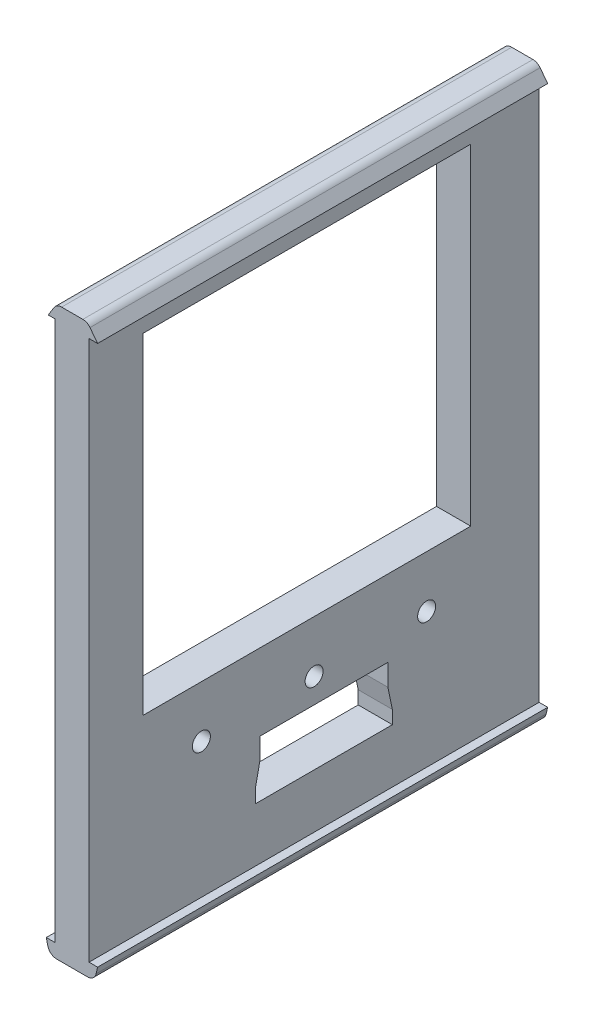
ISO-10303-21;
HEADER;
FILE_DESCRIPTION(('STEP AP214'),'2;1');
FILE_NAME('part.step','',(''),(''),'','','');
FILE_SCHEMA(('AUTOMOTIVE_DESIGN { 1 0 10303 214 1 1 1 1 }'));
ENDSEC;
DATA;
#1=APPLICATION_CONTEXT('core data for automotive mechanical design processes');
#2=APPLICATION_PROTOCOL_DEFINITION('international standard','automotive_design',2000,#1);
#3=PRODUCT_CONTEXT('',#1,'mechanical');
#4=PRODUCT('Part','Part','',(#3));
#5=PRODUCT_RELATED_PRODUCT_CATEGORY('part','',(#4));
#6=PRODUCT_DEFINITION_FORMATION('','',#4);
#7=PRODUCT_DEFINITION_CONTEXT('part definition',#1,'design');
#8=PRODUCT_DEFINITION('design','',#6,#7);
#9=PRODUCT_DEFINITION_SHAPE('','',#8);
#10=(LENGTH_UNIT() NAMED_UNIT(*) SI_UNIT(.MILLI.,.METRE.));
#11=(NAMED_UNIT(*) PLANE_ANGLE_UNIT() SI_UNIT($,.RADIAN.));
#12=(NAMED_UNIT(*) SI_UNIT($,.STERADIAN.) SOLID_ANGLE_UNIT());
#13=UNCERTAINTY_MEASURE_WITH_UNIT(LENGTH_MEASURE(1.E-05),#10,'distance_accuracy_value','');
#14=(GEOMETRIC_REPRESENTATION_CONTEXT(3) GLOBAL_UNCERTAINTY_ASSIGNED_CONTEXT((#13)) GLOBAL_UNIT_ASSIGNED_CONTEXT((#10,
#11,#12)) REPRESENTATION_CONTEXT('',''));
#15=CARTESIAN_POINT('',(0.,0.,0.));
#16=DIRECTION('',(0.,0.,1.));
#17=DIRECTION('',(1.,0.,0.));
#18=AXIS2_PLACEMENT_3D('',#15,#16,#17);
#19=CARTESIAN_POINT('',(-3.8,0.,160.));
#20=DIRECTION('',(-1.,0.,0.));
#21=DIRECTION('',(0.,-1.,0.));
#22=AXIS2_PLACEMENT_3D('',#19,#20,#21);
#23=PLANE('',#22);
#24=DIRECTION('',(0.,0.,1.));
#25=VECTOR('',#24,1.);
#26=CARTESIAN_POINT('',(-3.8,16.8213753410179,160.));
#27=LINE('',#26,#25);
#28=CARTESIAN_POINT('',(-3.8,16.8213753410179,45.2));
#29=VERTEX_POINT('',#28);
#30=CARTESIAN_POINT('',(-3.8,16.8213753410179,118.));
#31=VERTEX_POINT('',#30);
#32=EDGE_CURVE('E272',#29,#31,#27,.T.);
#33=ORIENTED_EDGE('',*,*,#32,.T.);
#34=DIRECTION('',(0.,-1.,0.));
#35=VECTOR('',#34,1.);
#36=CARTESIAN_POINT('',(-3.8,0.,118.));
#37=LINE('',#36,#35);
#38=CARTESIAN_POINT('',(-3.79999999999998,-56.678624658982,118.));
#39=VERTEX_POINT('',#38);
#40=EDGE_CURVE('E281',#31,#39,#37,.T.);
#41=ORIENTED_EDGE('',*,*,#40,.T.);
#42=DIRECTION('',(0.,0.,-1.));
#43=VECTOR('',#42,1.);
#44=CARTESIAN_POINT('',(-3.79999999999999,-56.678624658982,160.));
#45=LINE('',#44,#43);
#46=CARTESIAN_POINT('',(-3.79999999999999,-56.678624658982,45.2));
#47=VERTEX_POINT('',#46);
#48=EDGE_CURVE('E278',#39,#47,#45,.T.);
#49=ORIENTED_EDGE('',*,*,#48,.T.);
#50=DIRECTION('',(0.,1.,0.));
#51=VECTOR('',#50,1.);
#52=CARTESIAN_POINT('',(-3.8,0.,45.2));
#53=LINE('',#52,#51);
#54=EDGE_CURVE('E275',#47,#29,#53,.T.);
#55=ORIENTED_EDGE('',*,*,#54,.T.);
#56=EDGE_LOOP('',(#33,#41,#49,#55));
#57=FACE_BOUND('',#56,.T.);
#58=CARTESIAN_POINT('',(-3.79999999999999,-68.178624658982,55.));
#59=DIRECTION('',(-1.,0.,0.));
#60=DIRECTION('',(0.,-1.,0.));
#61=AXIS2_PLACEMENT_3D('',#58,#59,#60);
#62=CIRCLE('',#61,2.);
#63=CARTESIAN_POINT('',(-3.79999999999999,-70.178624658982,55.));
#64=VERTEX_POINT('',#63);
#65=EDGE_CURVE('E346',#64,#64,#62,.F.);
#66=ORIENTED_EDGE('',*,*,#65,.T.);
#67=EDGE_LOOP('',(#66));
#68=FACE_BOUND('',#67,.T.);
#69=DIRECTION('',(0.,-1.,0.));
#70=VECTOR('',#69,1.);
#71=CARTESIAN_POINT('',(-3.8,21.821375341018,130.));
#72=LINE('',#71,#70);
#73=CARTESIAN_POINT('',(-3.8,21.821375341018,130.));
#74=VERTEX_POINT('',#73);
#75=CARTESIAN_POINT('',(-3.8,-98.178624658982,130.));
#76=VERTEX_POINT('',#75);
#77=EDGE_CURVE('E356',#74,#76,#72,.T.);
#78=ORIENTED_EDGE('',*,*,#77,.F.);
#79=DIRECTION('',(0.,0.,-1.));
#80=VECTOR('',#79,1.);
#81=CARTESIAN_POINT('',(-3.8,21.821375341018,160.));
#82=LINE('',#81,#80);
#83=CARTESIAN_POINT('',(-3.8,21.821375341018,30.));
#84=VERTEX_POINT('',#83);
#85=EDGE_CURVE('E401',#74,#84,#82,.T.);
#86=ORIENTED_EDGE('',*,*,#85,.T.);
#87=DIRECTION('',(0.,-1.,0.));
#88=VECTOR('',#87,1.);
#89=CARTESIAN_POINT('',(-3.8,21.821375341018,30.));
#90=LINE('',#89,#88);
#91=CARTESIAN_POINT('',(-3.79999999999998,-98.178624658982,30.));
#92=VERTEX_POINT('',#91);
#93=EDGE_CURVE('E359',#84,#92,#90,.T.);
#94=ORIENTED_EDGE('',*,*,#93,.T.);
#95=DIRECTION('',(0.,0.,-1.));
#96=VECTOR('',#95,1.);
#97=CARTESIAN_POINT('',(-3.79999999999998,-98.178624658982,160.));
#98=LINE('',#97,#96);
#99=EDGE_CURVE('E405',#76,#92,#98,.T.);
#100=ORIENTED_EDGE('',*,*,#99,.F.);
#101=EDGE_LOOP('',(#78,#86,#94,#100));
#102=FACE_BOUND('',#101,.T.);
#103=CARTESIAN_POINT('',(-3.79999999999999,-68.178624658982,80.));
#104=DIRECTION('',(-1.,0.,0.));
#105=DIRECTION('',(0.,-1.,0.));
#106=AXIS2_PLACEMENT_3D('',#103,#104,#105);
#107=CIRCLE('',#106,2.);
#108=CARTESIAN_POINT('',(-3.79999999999999,-70.178624658982,80.));
#109=VERTEX_POINT('',#108);
#110=EDGE_CURVE('E352',#109,#109,#107,.F.);
#111=ORIENTED_EDGE('',*,*,#110,.T.);
#112=EDGE_LOOP('',(#111));
#113=FACE_BOUND('',#112,.T.);
#114=CARTESIAN_POINT('',(-3.79999999999999,-68.178624658982,105.042568922673));
#115=DIRECTION('',(-1.,0.,0.));
#116=DIRECTION('',(0.,-1.,0.));
#117=AXIS2_PLACEMENT_3D('',#114,#115,#116);
#118=CIRCLE('',#117,2.);
#119=CARTESIAN_POINT('',(-3.79999999999999,-70.178624658982,105.042568922673));
#120=VERTEX_POINT('',#119);
#121=EDGE_CURVE('E340',#120,#120,#118,.F.);
#122=ORIENTED_EDGE('',*,*,#121,.T.);
#123=EDGE_LOOP('',(#122));
#124=FACE_BOUND('',#123,.T.);
#125=DIRECTION('',(0.,0.97887309504818,0.204468735484905));
#126=VECTOR('',#125,1.);
#127=CARTESIAN_POINT('',(-3.8,16.0123896452633,83.3423272560244));
#128=LINE('',#127,#126);
#129=CARTESIAN_POINT('',(-3.79999999999998,-83.2534194825206,62.6075102793204));
#130=VERTEX_POINT('',#129);
#131=CARTESIAN_POINT('',(-3.79999999999998,-78.4660220707513,63.6075102793204));
#132=VERTEX_POINT('',#131);
#133=EDGE_CURVE('E224',#130,#132,#128,.T.);
#134=ORIENTED_EDGE('',*,*,#133,.T.);
#135=DIRECTION('',(0.,1.,0.));
#136=VECTOR('',#135,1.);
#137=CARTESIAN_POINT('',(-3.8,0.,63.6075102793204));
#138=LINE('',#137,#136);
#139=CARTESIAN_POINT('',(-3.79999999999998,-73.6786246589821,63.6075102793204));
#140=VERTEX_POINT('',#139);
#141=EDGE_CURVE('E259',#132,#140,#138,.T.);
#142=ORIENTED_EDGE('',*,*,#141,.T.);
#143=DIRECTION('',(0.,0.,1.));
#144=VECTOR('',#143,1.);
#145=CARTESIAN_POINT('',(-3.79999999999998,-73.6786246589821,160.));
#146=LINE('',#145,#144);
#147=CARTESIAN_POINT('',(-3.79999999999998,-73.6786246589821,92.0575102793204));
#148=VERTEX_POINT('',#147);
#149=EDGE_CURVE('E256',#140,#148,#146,.T.);
#150=ORIENTED_EDGE('',*,*,#149,.T.);
#151=DIRECTION('',(0.,-1.,0.));
#152=VECTOR('',#151,1.);
#153=CARTESIAN_POINT('',(-3.8,0.,92.0575102793204));
#154=LINE('',#153,#152);
#155=CARTESIAN_POINT('',(-3.79999999999998,-78.4660220707513,92.0575102793204));
#156=VERTEX_POINT('',#155);
#157=EDGE_CURVE('E253',#148,#156,#154,.T.);
#158=ORIENTED_EDGE('',*,*,#157,.T.);
#159=DIRECTION('',(0.,-0.97887309504818,0.204468735484907));
#160=VECTOR('',#159,1.);
#161=CARTESIAN_POINT('',(-3.79999999999999,-16.8790829430984,79.193122005172));
#162=LINE('',#161,#160);
#163=CARTESIAN_POINT('',(-3.79999999999998,-83.2534194825206,93.0575102793204));
#164=VERTEX_POINT('',#163);
#165=EDGE_CURVE('E250',#156,#164,#162,.T.);
#166=ORIENTED_EDGE('',*,*,#165,.T.);
#167=DIRECTION('',(0.,-1.,0.));
#168=VECTOR('',#167,1.);
#169=CARTESIAN_POINT('',(-3.8,0.,93.0575102793204));
#170=LINE('',#169,#168);
#171=CARTESIAN_POINT('',(-3.79999999999998,-86.1786246589821,93.0575102793204));
#172=VERTEX_POINT('',#171);
#173=EDGE_CURVE('E245',#164,#172,#170,.T.);
#174=ORIENTED_EDGE('',*,*,#173,.T.);
#175=DIRECTION('',(0.,0.,-1.));
#176=VECTOR('',#175,1.);
#177=CARTESIAN_POINT('',(-3.79999999999998,-86.1786246589821,160.));
#178=LINE('',#177,#176);
#179=CARTESIAN_POINT('',(-3.79999999999998,-86.1786246589821,62.6075102793204));
#180=VERTEX_POINT('',#179);
#181=EDGE_CURVE('E243',#172,#180,#178,.T.);
#182=ORIENTED_EDGE('',*,*,#181,.T.);
#183=DIRECTION('',(0.,1.,0.));
#184=VECTOR('',#183,1.);
#185=CARTESIAN_POINT('',(-3.8,0.,62.6075102793204));
#186=LINE('',#185,#184);
#187=EDGE_CURVE('E229',#180,#130,#186,.T.);
#188=ORIENTED_EDGE('',*,*,#187,.T.);
#189=EDGE_LOOP('',(#134,#142,#150,#158,#166,#174,#182,#188));
#190=FACE_BOUND('',#189,.T.);
#191=ADVANCED_FACE('F44',(#57,#68,#102,#113,#124,#190),#23,.T.);
#192=CARTESIAN_POINT('',(3.8,0.,160.));
#193=DIRECTION('',(-1.,0.,0.));
#194=DIRECTION('',(0.,-1.,0.));
#195=AXIS2_PLACEMENT_3D('',#192,#193,#194);
#196=PLANE('',#195);
#197=DIRECTION('',(0.,-1.,0.));
#198=VECTOR('',#197,1.);
#199=CARTESIAN_POINT('',(3.8,0.,118.));
#200=LINE('',#199,#198);
#201=CARTESIAN_POINT('',(3.8,16.821375341018,118.));
#202=VERTEX_POINT('',#201);
#203=CARTESIAN_POINT('',(3.80000000000001,-56.678624658982,118.));
#204=VERTEX_POINT('',#203);
#205=EDGE_CURVE('E556',#202,#204,#200,.T.);
#206=ORIENTED_EDGE('',*,*,#205,.F.);
#207=DIRECTION('',(0.,0.,1.));
#208=VECTOR('',#207,1.);
#209=CARTESIAN_POINT('',(3.8,16.821375341018,160.));
#210=LINE('',#209,#208);
#211=CARTESIAN_POINT('',(3.8,16.821375341018,45.2));
#212=VERTEX_POINT('',#211);
#213=EDGE_CURVE('E481',#212,#202,#210,.T.);
#214=ORIENTED_EDGE('',*,*,#213,.F.);
#215=DIRECTION('',(0.,1.,0.));
#216=VECTOR('',#215,1.);
#217=CARTESIAN_POINT('',(3.8,0.,45.2));
#218=LINE('',#217,#216);
#219=CARTESIAN_POINT('',(3.80000000000001,-56.678624658982,45.2));
#220=VERTEX_POINT('',#219);
#221=EDGE_CURVE('E753',#220,#212,#218,.T.);
#222=ORIENTED_EDGE('',*,*,#221,.F.);
#223=DIRECTION('',(0.,0.,-1.));
#224=VECTOR('',#223,1.);
#225=CARTESIAN_POINT('',(3.80000000000001,-56.678624658982,160.));
#226=LINE('',#225,#224);
#227=EDGE_CURVE('E755',#204,#220,#226,.T.);
#228=ORIENTED_EDGE('',*,*,#227,.F.);
#229=EDGE_LOOP('',(#206,#214,#222,#228));
#230=FACE_BOUND('',#229,.T.);
#231=CARTESIAN_POINT('',(3.80000000000002,-68.178624658982,55.));
#232=DIRECTION('',(1.,0.,0.));
#233=DIRECTION('',(0.,0.,-1.));
#234=AXIS2_PLACEMENT_3D('',#231,#232,#233);
#235=CIRCLE('',#234,2.);
#236=CARTESIAN_POINT('',(3.80000000000002,-68.178624658982,53.));
#237=VERTEX_POINT('',#236);
#238=EDGE_CURVE('E343',#237,#237,#235,.T.);
#239=ORIENTED_EDGE('',*,*,#238,.F.);
#240=EDGE_LOOP('',(#239));
#241=FACE_BOUND('',#240,.T.);
#242=DIRECTION('',(0.,0.,-1.));
#243=VECTOR('',#242,1.);
#244=CARTESIAN_POINT('',(3.8,21.821375341018,160.));
#245=LINE('',#244,#243);
#246=CARTESIAN_POINT('',(3.8,21.821375341018,130.));
#247=VERTEX_POINT('',#246);
#248=CARTESIAN_POINT('',(3.8,21.821375341018,30.));
#249=VERTEX_POINT('',#248);
#250=EDGE_CURVE('E389',#247,#249,#245,.T.);
#251=ORIENTED_EDGE('',*,*,#250,.F.);
#252=DIRECTION('',(0.,1.,0.));
#253=VECTOR('',#252,1.);
#254=CARTESIAN_POINT('',(3.80000000000002,21.821375341018,130.));
#255=LINE('',#254,#253);
#256=CARTESIAN_POINT('',(3.80000000000002,-98.178624658982,130.));
#257=VERTEX_POINT('',#256);
#258=EDGE_CURVE('E355',#257,#247,#255,.T.);
#259=ORIENTED_EDGE('',*,*,#258,.F.);
#260=DIRECTION('',(0.,0.,-1.));
#261=VECTOR('',#260,1.);
#262=CARTESIAN_POINT('',(3.80000000000002,-98.178624658982,160.));
#263=LINE('',#262,#261);
#264=CARTESIAN_POINT('',(3.80000000000002,-98.178624658982,30.));
#265=VERTEX_POINT('',#264);
#266=EDGE_CURVE('E398',#257,#265,#263,.T.);
#267=ORIENTED_EDGE('',*,*,#266,.T.);
#268=DIRECTION('',(0.,1.,0.));
#269=VECTOR('',#268,1.);
#270=CARTESIAN_POINT('',(3.80000000000002,21.821375341018,30.));
#271=LINE('',#270,#269);
#272=EDGE_CURVE('E368',#265,#249,#271,.T.);
#273=ORIENTED_EDGE('',*,*,#272,.T.);
#274=EDGE_LOOP('',(#251,#259,#267,#273));
#275=FACE_BOUND('',#274,.T.);
#276=CARTESIAN_POINT('',(3.80000000000002,-68.178624658982,80.));
#277=DIRECTION('',(1.,0.,0.));
#278=DIRECTION('',(0.,0.,-1.));
#279=AXIS2_PLACEMENT_3D('',#276,#277,#278);
#280=CIRCLE('',#279,2.);
#281=CARTESIAN_POINT('',(3.80000000000002,-68.178624658982,78.));
#282=VERTEX_POINT('',#281);
#283=EDGE_CURVE('E349',#282,#282,#280,.T.);
#284=ORIENTED_EDGE('',*,*,#283,.F.);
#285=EDGE_LOOP('',(#284));
#286=FACE_BOUND('',#285,.T.);
#287=CARTESIAN_POINT('',(3.80000000000002,-68.178624658982,105.042568922673));
#288=DIRECTION('',(1.,0.,0.));
#289=DIRECTION('',(0.,0.,-1.));
#290=AXIS2_PLACEMENT_3D('',#287,#288,#289);
#291=CIRCLE('',#290,2.);
#292=CARTESIAN_POINT('',(3.80000000000002,-68.178624658982,103.042568922673));
#293=VERTEX_POINT('',#292);
#294=EDGE_CURVE('E337',#293,#293,#291,.T.);
#295=ORIENTED_EDGE('',*,*,#294,.F.);
#296=EDGE_LOOP('',(#295));
#297=FACE_BOUND('',#296,.T.);
#298=DIRECTION('',(0.,1.,0.));
#299=VECTOR('',#298,1.);
#300=CARTESIAN_POINT('',(3.8,0.,63.6075102793204));
#301=LINE('',#300,#299);
#302=CARTESIAN_POINT('',(3.80000000000002,-78.4660220707513,63.6075102793204));
#303=VERTEX_POINT('',#302);
#304=CARTESIAN_POINT('',(3.80000000000002,-73.6786246589821,63.6075102793204));
#305=VERTEX_POINT('',#304);
#306=EDGE_CURVE('E12',#303,#305,#301,.T.);
#307=ORIENTED_EDGE('',*,*,#306,.F.);
#308=DIRECTION('',(0.,0.97887309504818,0.204468735484905));
#309=VECTOR('',#308,1.);
#310=CARTESIAN_POINT('',(3.8,16.0123896452633,83.3423272560244));
#311=LINE('',#310,#309);
#312=CARTESIAN_POINT('',(3.80000000000002,-83.2534194825206,62.6075102793204));
#313=VERTEX_POINT('',#312);
#314=EDGE_CURVE('E524',#313,#303,#311,.T.);
#315=ORIENTED_EDGE('',*,*,#314,.F.);
#316=DIRECTION('',(0.,1.,0.));
#317=VECTOR('',#316,1.);
#318=CARTESIAN_POINT('',(3.8,0.,62.6075102793204));
#319=LINE('',#318,#317);
#320=CARTESIAN_POINT('',(3.80000000000002,-86.1786246589821,62.6075102793204));
#321=VERTEX_POINT('',#320);
#322=EDGE_CURVE('E237',#321,#313,#319,.T.);
#323=ORIENTED_EDGE('',*,*,#322,.F.);
#324=DIRECTION('',(0.,0.,-1.));
#325=VECTOR('',#324,1.);
#326=CARTESIAN_POINT('',(3.80000000000002,-86.1786246589821,160.));
#327=LINE('',#326,#325);
#328=CARTESIAN_POINT('',(3.80000000000002,-86.1786246589821,93.0575102793204));
#329=VERTEX_POINT('',#328);
#330=EDGE_CURVE('E551',#329,#321,#327,.T.);
#331=ORIENTED_EDGE('',*,*,#330,.F.);
#332=DIRECTION('',(0.,-1.,0.));
#333=VECTOR('',#332,1.);
#334=CARTESIAN_POINT('',(3.8,0.,93.0575102793204));
#335=LINE('',#334,#333);
#336=CARTESIAN_POINT('',(3.80000000000002,-83.2534194825206,93.0575102793204));
#337=VERTEX_POINT('',#336);
#338=EDGE_CURVE('E554',#337,#329,#335,.T.);
#339=ORIENTED_EDGE('',*,*,#338,.F.);
#340=DIRECTION('',(0.,-0.97887309504818,0.204468735484907));
#341=VECTOR('',#340,1.);
#342=CARTESIAN_POINT('',(3.80000000000001,-16.8790829430984,79.193122005172));
#343=LINE('',#342,#341);
#344=CARTESIAN_POINT('',(3.80000000000002,-78.4660220707513,92.0575102793204));
#345=VERTEX_POINT('',#344);
#346=EDGE_CURVE('E561',#345,#337,#343,.T.);
#347=ORIENTED_EDGE('',*,*,#346,.F.);
#348=DIRECTION('',(0.,-1.,0.));
#349=VECTOR('',#348,1.);
#350=CARTESIAN_POINT('',(3.8,0.,92.0575102793204));
#351=LINE('',#350,#349);
#352=CARTESIAN_POINT('',(3.80000000000002,-73.6786246589821,92.0575102793204));
#353=VERTEX_POINT('',#352);
#354=EDGE_CURVE('E563',#353,#345,#351,.T.);
#355=ORIENTED_EDGE('',*,*,#354,.F.);
#356=DIRECTION('',(0.,0.,1.));
#357=VECTOR('',#356,1.);
#358=CARTESIAN_POINT('',(3.80000000000002,-73.6786246589821,160.));
#359=LINE('',#358,#357);
#360=EDGE_CURVE('E51',#305,#353,#359,.T.);
#361=ORIENTED_EDGE('',*,*,#360,.F.);
#362=EDGE_LOOP('',(#307,#315,#323,#331,#339,#347,#355,#361));
#363=FACE_BOUND('',#362,.T.);
#364=ADVANCED_FACE('F506',(#230,#241,#275,#286,#297,#363),#196,.F.);
#365=CARTESIAN_POINT('',(-7.17106379094956E-13,-98.178624658982,160.));
#366=DIRECTION('',(0.,1.,0.));
#367=DIRECTION('',(-1.,0.,0.));
#368=AXIS2_PLACEMENT_3D('',#365,#366,#367);
#369=PLANE('',#368);
#370=DIRECTION('',(1.,0.,0.));
#371=VECTOR('',#370,1.);
#372=CARTESIAN_POINT('',(-7.17106379094956E-13,-98.178624658982,30.));
#373=LINE('',#372,#371);
#374=CARTESIAN_POINT('',(-5.69999999999999,-98.178624658982,30.));
#375=VERTEX_POINT('',#374);
#376=EDGE_CURVE('E299',#375,#92,#373,.T.);
#377=ORIENTED_EDGE('',*,*,#376,.F.);
#378=DIRECTION('',(0.,0.,-1.));
#379=VECTOR('',#378,1.);
#380=CARTESIAN_POINT('',(-5.69999999999999,-98.178624658982,160.));
#381=LINE('',#380,#379);
#382=CARTESIAN_POINT('',(-5.69999999999999,-98.178624658982,130.));
#383=VERTEX_POINT('',#382);
#384=EDGE_CURVE('E411',#383,#375,#381,.T.);
#385=ORIENTED_EDGE('',*,*,#384,.F.);
#386=DIRECTION('',(-1.,0.,0.));
#387=VECTOR('',#386,1.);
#388=CARTESIAN_POINT('',(-7.17106379094956E-13,-98.178624658982,130.));
#389=LINE('',#388,#387);
#390=EDGE_CURVE('E321',#76,#383,#389,.T.);
#391=ORIENTED_EDGE('',*,*,#390,.F.);
#392=ORIENTED_EDGE('',*,*,#99,.T.);
#393=EDGE_LOOP('',(#377,#385,#391,#392));
#394=FACE_BOUND('',#393,.T.);
#395=ADVANCED_FACE('F467',(#394),#369,.T.);
#396=CARTESIAN_POINT('',(0.,21.821375341018,160.));
#397=DIRECTION('',(0.,-1.,0.));
#398=DIRECTION('',(0.,0.,-1.));
#399=AXIS2_PLACEMENT_3D('',#396,#397,#398);
#400=PLANE('',#399);
#401=DIRECTION('',(-1.,0.,0.));
#402=VECTOR('',#401,1.);
#403=CARTESIAN_POINT('',(0.,21.821375341018,30.));
#404=LINE('',#403,#402);
#405=CARTESIAN_POINT('',(5.70000000000001,21.821375341018,30.));
#406=VERTEX_POINT('',#405);
#407=EDGE_CURVE('E291',#406,#249,#404,.T.);
#408=ORIENTED_EDGE('',*,*,#407,.F.);
#409=DIRECTION('',(0.,0.,-1.));
#410=VECTOR('',#409,1.);
#411=CARTESIAN_POINT('',(5.70000000000001,21.821375341018,160.));
#412=LINE('',#411,#410);
#413=CARTESIAN_POINT('',(5.70000000000001,21.821375341018,130.));
#414=VERTEX_POINT('',#413);
#415=EDGE_CURVE('E386',#414,#406,#412,.T.);
#416=ORIENTED_EDGE('',*,*,#415,.F.);
#417=DIRECTION('',(1.,0.,0.));
#418=VECTOR('',#417,1.);
#419=CARTESIAN_POINT('',(0.,21.821375341018,130.));
#420=LINE('',#419,#418);
#421=EDGE_CURVE('E327',#247,#414,#420,.T.);
#422=ORIENTED_EDGE('',*,*,#421,.F.);
#423=ORIENTED_EDGE('',*,*,#250,.T.);
#424=EDGE_LOOP('',(#408,#416,#422,#423));
#425=FACE_BOUND('',#424,.T.);
#426=ADVANCED_FACE('F503',(#425),#400,.T.);
#427=CARTESIAN_POINT('',(-27.1312025062026,-6.33061391811397,160.));
#428=DIRECTION('',(-0.973841209741793,-0.227229615606419,0.));
#429=DIRECTION('',(0.227229615606419,-0.973841209741793,0.));
#430=AXIS2_PLACEMENT_3D('',#427,#428,#429);
#431=PLANE('',#430);
#432=DIRECTION('',(-0.227229615606419,0.973841209741793,0.));
#433=VECTOR('',#432,1.);
#434=CARTESIAN_POINT('',(-27.1312025062026,-6.33061391811397,30.));
#435=LINE('',#434,#433);
#436=CARTESIAN_POINT('',(-5.36062617938365,-99.6330838901949,30.));
#437=VERTEX_POINT('',#436);
#438=EDGE_CURVE('E311',#437,#375,#435,.T.);
#439=ORIENTED_EDGE('',*,*,#438,.F.);
#440=DIRECTION('',(0.,0.,-1.));
#441=VECTOR('',#440,1.);
#442=CARTESIAN_POINT('',(-5.36062617938366,-99.6330838901949,160.));
#443=LINE('',#442,#441);
#444=CARTESIAN_POINT('',(-5.36062617938366,-99.6330838901949,130.));
#445=VERTEX_POINT('',#444);
#446=EDGE_CURVE('E417',#445,#437,#443,.T.);
#447=ORIENTED_EDGE('',*,*,#446,.F.);
#448=DIRECTION('',(0.227229615606419,-0.973841209741793,0.));
#449=VECTOR('',#448,1.);
#450=CARTESIAN_POINT('',(-27.1312025062026,-6.33061391811397,130.));
#451=LINE('',#450,#449);
#452=EDGE_CURVE('E463',#383,#445,#451,.T.);
#453=ORIENTED_EDGE('',*,*,#452,.F.);
#454=ORIENTED_EDGE('',*,*,#384,.T.);
#455=EDGE_LOOP('',(#439,#447,#453,#454));
#456=FACE_BOUND('',#455,.T.);
#457=ADVANCED_FACE('F462',(#456),#431,.T.);
#458=CARTESIAN_POINT('',(-3.41294375990007,-99.178624658982,160.));
#459=DIRECTION('',(0.,0.,-1.));
#460=DIRECTION('',(-1.,0.,0.));
#461=AXIS2_PLACEMENT_3D('',#458,#459,#460);
#462=CYLINDRICAL_SURFACE('',#461,2.);
#463=ORIENTED_EDGE('',*,*,#446,.T.);
#464=CARTESIAN_POINT('',(-3.41294375990007,-99.178624658982,30.));
#465=DIRECTION('',(0.,0.,1.));
#466=DIRECTION('',(1.,0.,0.));
#467=AXIS2_PLACEMENT_3D('',#464,#465,#466);
#468=CIRCLE('',#467,2.);
#469=CARTESIAN_POINT('',(-3.41294375990007,-101.178624658982,30.));
#470=VERTEX_POINT('',#469);
#471=EDGE_CURVE('E308',#437,#470,#468,.T.);
#472=ORIENTED_EDGE('',*,*,#471,.T.);
#473=DIRECTION('',(0.,0.,-1.));
#474=VECTOR('',#473,1.);
#475=CARTESIAN_POINT('',(-3.41294375990007,-101.178624658982,160.));
#476=LINE('',#475,#474);
#477=CARTESIAN_POINT('',(-3.41294375990007,-101.178624658982,130.));
#478=VERTEX_POINT('',#477);
#479=EDGE_CURVE('E420',#478,#470,#476,.T.);
#480=ORIENTED_EDGE('',*,*,#479,.F.);
#481=CARTESIAN_POINT('',(-3.41294375990007,-99.178624658982,130.));
#482=DIRECTION('',(0.,0.,-1.));
#483=DIRECTION('',(-1.,0.,0.));
#484=AXIS2_PLACEMENT_3D('',#481,#482,#483);
#485=CIRCLE('',#484,2.);
#486=EDGE_CURVE('E459',#478,#445,#485,.T.);
#487=ORIENTED_EDGE('',*,*,#486,.T.);
#488=EDGE_LOOP('',(#463,#472,#480,#487));
#489=FACE_BOUND('',#488,.T.);
#490=ADVANCED_FACE('F456',(#489),#462,.T.);
#491=CARTESIAN_POINT('',(0.,-101.178624658982,160.));
#492=DIRECTION('',(0.,1.,0.));
#493=DIRECTION('',(0.,0.,1.));
#494=AXIS2_PLACEMENT_3D('',#491,#492,#493);
#495=PLANE('',#494);
#496=ORIENTED_EDGE('',*,*,#479,.T.);
#497=DIRECTION('',(1.,0.,0.));
#498=VECTOR('',#497,1.);
#499=CARTESIAN_POINT('',(0.,-101.178624658982,30.));
#500=LINE('',#499,#498);
#501=CARTESIAN_POINT('',(3.4129437599001,-101.178624658982,30.));
#502=VERTEX_POINT('',#501);
#503=EDGE_CURVE('E305',#470,#502,#500,.T.);
#504=ORIENTED_EDGE('',*,*,#503,.T.);
#505=DIRECTION('',(0.,0.,-1.));
#506=VECTOR('',#505,1.);
#507=CARTESIAN_POINT('',(3.4129437599001,-101.178624658982,160.));
#508=LINE('',#507,#506);
#509=CARTESIAN_POINT('',(3.4129437599001,-101.178624658982,130.));
#510=VERTEX_POINT('',#509);
#511=EDGE_CURVE('E423',#510,#502,#508,.T.);
#512=ORIENTED_EDGE('',*,*,#511,.F.);
#513=DIRECTION('',(-1.,0.,0.));
#514=VECTOR('',#513,1.);
#515=CARTESIAN_POINT('',(0.,-101.178624658982,130.));
#516=LINE('',#515,#514);
#517=EDGE_CURVE('E452',#510,#478,#516,.T.);
#518=ORIENTED_EDGE('',*,*,#517,.T.);
#519=EDGE_LOOP('',(#496,#504,#512,#518));
#520=FACE_BOUND('',#519,.T.);
#521=ADVANCED_FACE('F451',(#520),#495,.F.);
#522=CARTESIAN_POINT('',(3.4129437599001,-99.178624658982,160.));
#523=DIRECTION('',(0.,0.,-1.));
#524=DIRECTION('',(-1.,0.,0.));
#525=AXIS2_PLACEMENT_3D('',#522,#523,#524);
#526=CYLINDRICAL_SURFACE('',#525,2.);
#527=ORIENTED_EDGE('',*,*,#511,.T.);
#528=CARTESIAN_POINT('',(3.4129437599001,-99.178624658982,30.));
#529=DIRECTION('',(0.,0.,1.));
#530=DIRECTION('',(1.,0.,0.));
#531=AXIS2_PLACEMENT_3D('',#528,#529,#530);
#532=CIRCLE('',#531,2.);
#533=CARTESIAN_POINT('',(5.3606261793837,-99.6330838901949,30.));
#534=VERTEX_POINT('',#533);
#535=EDGE_CURVE('E302',#502,#534,#532,.T.);
#536=ORIENTED_EDGE('',*,*,#535,.T.);
#537=DIRECTION('',(0.,0.,-1.));
#538=VECTOR('',#537,1.);
#539=CARTESIAN_POINT('',(5.3606261793837,-99.6330838901949,160.));
#540=LINE('',#539,#538);
#541=CARTESIAN_POINT('',(5.36062617938369,-99.6330838901949,130.));
#542=VERTEX_POINT('',#541);
#543=EDGE_CURVE('E426',#542,#534,#540,.T.);
#544=ORIENTED_EDGE('',*,*,#543,.F.);
#545=CARTESIAN_POINT('',(3.4129437599001,-99.178624658982,130.));
#546=DIRECTION('',(0.,0.,-1.));
#547=DIRECTION('',(-1.,0.,0.));
#548=AXIS2_PLACEMENT_3D('',#545,#546,#547);
#549=CIRCLE('',#548,2.);
#550=EDGE_CURVE('E448',#542,#510,#549,.T.);
#551=ORIENTED_EDGE('',*,*,#550,.T.);
#552=EDGE_LOOP('',(#527,#536,#544,#551));
#553=FACE_BOUND('',#552,.T.);
#554=ADVANCED_FACE('F445',(#553),#526,.T.);
#555=CARTESIAN_POINT('',(27.1312025062019,-6.33061391811356,160.));
#556=DIRECTION('',(0.973841209741795,-0.227229615606411,0.));
#557=DIRECTION('',(0.227229615606411,0.973841209741795,0.));
#558=AXIS2_PLACEMENT_3D('',#555,#556,#557);
#559=PLANE('',#558);
#560=DIRECTION('',(-0.227229615606411,-0.973841209741795,0.));
#561=VECTOR('',#560,1.);
#562=CARTESIAN_POINT('',(27.1312025062019,-6.33061391811356,30.));
#563=LINE('',#562,#561);
#564=CARTESIAN_POINT('',(5.70000000000001,-98.1786246589821,30.));
#565=VERTEX_POINT('',#564);
#566=EDGE_CURVE('E300',#565,#534,#563,.T.);
#567=ORIENTED_EDGE('',*,*,#566,.F.);
#568=DIRECTION('',(0.,0.,-1.));
#569=VECTOR('',#568,1.);
#570=CARTESIAN_POINT('',(5.70000000000001,-98.1786246589821,160.));
#571=LINE('',#570,#569);
#572=CARTESIAN_POINT('',(5.70000000000001,-98.1786246589821,130.));
#573=VERTEX_POINT('',#572);
#574=EDGE_CURVE('E408',#573,#565,#571,.T.);
#575=ORIENTED_EDGE('',*,*,#574,.F.);
#576=DIRECTION('',(0.227229615606411,0.973841209741795,0.));
#577=VECTOR('',#576,1.);
#578=CARTESIAN_POINT('',(27.1312025062019,-6.33061391811356,130.));
#579=LINE('',#578,#577);
#580=EDGE_CURVE('E438',#542,#573,#579,.T.);
#581=ORIENTED_EDGE('',*,*,#580,.F.);
#582=ORIENTED_EDGE('',*,*,#543,.T.);
#583=EDGE_LOOP('',(#567,#575,#581,#582));
#584=FACE_BOUND('',#583,.T.);
#585=ADVANCED_FACE('F437',(#584),#559,.T.);
#586=EDGE_CURVE('E297',#265,#565,#373,.T.);
#587=ORIENTED_EDGE('',*,*,#586,.F.);
#588=ORIENTED_EDGE('',*,*,#266,.F.);
#589=EDGE_CURVE('E331',#573,#257,#389,.T.);
#590=ORIENTED_EDGE('',*,*,#589,.F.);
#591=ORIENTED_EDGE('',*,*,#574,.T.);
#592=EDGE_LOOP('',(#587,#588,#590,#591));
#593=FACE_BOUND('',#592,.T.);
#594=ADVANCED_FACE('F432',(#593),#369,.T.);
#595=CARTESIAN_POINT('',(-5.26679924331625,21.821375341018,30.));
#596=VERTEX_POINT('',#595);
#597=EDGE_CURVE('E289',#84,#596,#404,.T.);
#598=ORIENTED_EDGE('',*,*,#597,.F.);
#599=ORIENTED_EDGE('',*,*,#85,.F.);
#600=CARTESIAN_POINT('',(-5.26679924331625,21.821375341018,130.));
#601=VERTEX_POINT('',#600);
#602=EDGE_CURVE('E319',#601,#74,#420,.T.);
#603=ORIENTED_EDGE('',*,*,#602,.F.);
#604=DIRECTION('',(0.,0.,-1.));
#605=VECTOR('',#604,1.);
#606=CARTESIAN_POINT('',(-5.26679924331625,21.821375341018,160.));
#607=LINE('',#606,#605);
#608=EDGE_CURVE('E371',#601,#596,#607,.T.);
#609=ORIENTED_EDGE('',*,*,#608,.T.);
#610=EDGE_LOOP('',(#598,#599,#603,#609));
#611=FACE_BOUND('',#610,.T.);
#612=ADVANCED_FACE('F483',(#611),#400,.T.);
#613=CARTESIAN_POINT('',(14.1258813531818,10.7688950319018,160.));
#614=DIRECTION('',(-0.795260200775992,-0.606268268229279,0.));
#615=DIRECTION('',(0.606268268229279,-0.795260200775992,0.));
#616=AXIS2_PLACEMENT_3D('',#613,#614,#615);
#617=PLANE('',#616);
#618=ORIENTED_EDGE('',*,*,#415,.T.);
#619=DIRECTION('',(-0.606268268229279,0.795260200775992,0.));
#620=VECTOR('',#619,1.);
#621=CARTESIAN_POINT('',(14.1258813531818,10.7688950319018,30.));
#622=LINE('',#621,#620);
#623=CARTESIAN_POINT('',(4.01326816928115,24.0339118774765,30.));
#624=VERTEX_POINT('',#623);
#625=EDGE_CURVE('E292',#406,#624,#622,.T.);
#626=ORIENTED_EDGE('',*,*,#625,.T.);
#627=DIRECTION('',(0.,0.,-1.));
#628=VECTOR('',#627,1.);
#629=CARTESIAN_POINT('',(4.01326816928115,24.0339118774765,160.));
#630=LINE('',#629,#628);
#631=CARTESIAN_POINT('',(4.01326816928115,24.0339118774765,130.));
#632=VERTEX_POINT('',#631);
#633=EDGE_CURVE('E383',#632,#624,#630,.T.);
#634=ORIENTED_EDGE('',*,*,#633,.F.);
#635=DIRECTION('',(0.606268268229279,-0.795260200775992,0.));
#636=VECTOR('',#635,1.);
#637=CARTESIAN_POINT('',(14.1258813531818,10.7688950319018,130.));
#638=LINE('',#637,#636);
#639=EDGE_CURVE('E330',#632,#414,#638,.T.);
#640=ORIENTED_EDGE('',*,*,#639,.T.);
#641=EDGE_LOOP('',(#618,#626,#634,#640));
#642=FACE_BOUND('',#641,.T.);
#643=ADVANCED_FACE('F500',(#642),#617,.F.);
#644=CARTESIAN_POINT('',(2.42274776772917,22.8213753410179,160.));
#645=DIRECTION('',(0.,0.,-1.));
#646=DIRECTION('',(-1.,0.,0.));
#647=AXIS2_PLACEMENT_3D('',#644,#645,#646);
#648=CYLINDRICAL_SURFACE('',#647,2.);
#649=CARTESIAN_POINT('',(2.42274776772917,22.8213753410179,30.));
#650=DIRECTION('',(0.,0.,1.));
#651=DIRECTION('',(1.,0.,0.));
#652=AXIS2_PLACEMENT_3D('',#649,#650,#651);
#653=CIRCLE('',#652,2.);
#654=CARTESIAN_POINT('',(2.42274776772917,24.821375341018,30.));
#655=VERTEX_POINT('',#654);
#656=EDGE_CURVE('E295',#655,#624,#653,.F.);
#657=ORIENTED_EDGE('',*,*,#656,.F.);
#658=DIRECTION('',(0.,0.,-1.));
#659=VECTOR('',#658,1.);
#660=CARTESIAN_POINT('',(2.42274776772917,24.821375341018,160.));
#661=LINE('',#660,#659);
#662=CARTESIAN_POINT('',(2.42274776772917,24.821375341018,130.));
#663=VERTEX_POINT('',#662);
#664=EDGE_CURVE('E380',#663,#655,#661,.T.);
#665=ORIENTED_EDGE('',*,*,#664,.F.);
#666=CARTESIAN_POINT('',(2.42274776772917,22.8213753410179,130.));
#667=DIRECTION('',(0.,0.,-1.));
#668=DIRECTION('',(-1.,0.,0.));
#669=AXIS2_PLACEMENT_3D('',#666,#667,#668);
#670=CIRCLE('',#669,2.);
#671=EDGE_CURVE('E335',#632,#663,#670,.F.);
#672=ORIENTED_EDGE('',*,*,#671,.F.);
#673=ORIENTED_EDGE('',*,*,#633,.T.);
#674=EDGE_LOOP('',(#657,#665,#672,#673));
#675=FACE_BOUND('',#674,.T.);
#676=ADVANCED_FACE('F496',(#675),#648,.T.);
#677=CARTESIAN_POINT('',(0.,24.821375341018,160.));
#678=DIRECTION('',(0.,-1.,0.));
#679=DIRECTION('',(1.,0.,0.));
#680=AXIS2_PLACEMENT_3D('',#677,#678,#679);
#681=PLANE('',#680);
#682=ORIENTED_EDGE('',*,*,#664,.T.);
#683=DIRECTION('',(1.,0.,0.));
#684=VECTOR('',#683,1.);
#685=CARTESIAN_POINT('',(-22.,24.821375341018,30.));
#686=LINE('',#685,#684);
#687=CARTESIAN_POINT('',(-2.29779279131514,24.821375341018,30.));
#688=VERTEX_POINT('',#687);
#689=EDGE_CURVE('E284',#688,#655,#686,.T.);
#690=ORIENTED_EDGE('',*,*,#689,.F.);
#691=DIRECTION('',(0.,0.,-1.));
#692=VECTOR('',#691,1.);
#693=CARTESIAN_POINT('',(-2.29779279131514,24.821375341018,160.));
#694=LINE('',#693,#692);
#695=CARTESIAN_POINT('',(-2.29779279131514,24.821375341018,130.));
#696=VERTEX_POINT('',#695);
#697=EDGE_CURVE('E377',#696,#688,#694,.T.);
#698=ORIENTED_EDGE('',*,*,#697,.F.);
#699=DIRECTION('',(1.,0.,0.));
#700=VECTOR('',#699,1.);
#701=CARTESIAN_POINT('',(-22.,24.821375341018,130.));
#702=LINE('',#701,#700);
#703=EDGE_CURVE('E313',#696,#663,#702,.T.);
#704=ORIENTED_EDGE('',*,*,#703,.T.);
#705=EDGE_LOOP('',(#682,#690,#698,#704));
#706=FACE_BOUND('',#705,.T.);
#707=ADVANCED_FACE('F492',(#706),#681,.F.);
#708=CARTESIAN_POINT('',(-2.29779279131514,22.8213753410179,160.));
#709=DIRECTION('',(0.,0.,-1.));
#710=DIRECTION('',(-1.,0.,0.));
#711=AXIS2_PLACEMENT_3D('',#708,#709,#710);
#712=CYLINDRICAL_SURFACE('',#711,2.);
#713=ORIENTED_EDGE('',*,*,#697,.T.);
#714=CARTESIAN_POINT('',(-2.29779279131514,22.8213753410179,30.));
#715=DIRECTION('',(0.,0.,1.));
#716=DIRECTION('',(1.,0.,0.));
#717=AXIS2_PLACEMENT_3D('',#714,#715,#716);
#718=CIRCLE('',#717,2.);
#719=CARTESIAN_POINT('',(-3.99915691907052,23.8727364135269,30.));
#720=VERTEX_POINT('',#719);
#721=EDGE_CURVE('E286',#688,#720,#718,.T.);
#722=ORIENTED_EDGE('',*,*,#721,.T.);
#723=DIRECTION('',(0.,0.,-1.));
#724=VECTOR('',#723,1.);
#725=CARTESIAN_POINT('',(-3.99915691907052,23.8727364135269,160.));
#726=LINE('',#725,#724);
#727=CARTESIAN_POINT('',(-3.99915691907052,23.8727364135269,130.));
#728=VERTEX_POINT('',#727);
#729=EDGE_CURVE('E374',#728,#720,#726,.T.);
#730=ORIENTED_EDGE('',*,*,#729,.F.);
#731=CARTESIAN_POINT('',(-2.29779279131514,22.8213753410179,130.));
#732=DIRECTION('',(0.,0.,-1.));
#733=DIRECTION('',(-1.,0.,0.));
#734=AXIS2_PLACEMENT_3D('',#731,#732,#733);
#735=CIRCLE('',#734,2.);
#736=EDGE_CURVE('E316',#728,#696,#735,.T.);
#737=ORIENTED_EDGE('',*,*,#736,.T.);
#738=EDGE_LOOP('',(#713,#722,#730,#737));
#739=FACE_BOUND('',#738,.T.);
#740=ADVANCED_FACE('F487',(#739),#712,.T.);
#741=CARTESIAN_POINT('',(-13.5696072539082,8.38536360515385,160.));
#742=DIRECTION('',(0.850682063877688,-0.52568053625448,0.));
#743=DIRECTION('',(0.52568053625448,0.850682063877688,0.));
#744=AXIS2_PLACEMENT_3D('',#741,#742,#743);
#745=PLANE('',#744);
#746=ORIENTED_EDGE('',*,*,#729,.T.);
#747=DIRECTION('',(-0.52568053625448,-0.850682063877688,0.));
#748=VECTOR('',#747,1.);
#749=CARTESIAN_POINT('',(-13.5696072539082,8.38536360515385,30.));
#750=LINE('',#749,#748);
#751=EDGE_CURVE('E474',#720,#596,#750,.T.);
#752=ORIENTED_EDGE('',*,*,#751,.T.);
#753=ORIENTED_EDGE('',*,*,#608,.F.);
#754=DIRECTION('',(0.52568053625448,0.850682063877688,0.));
#755=VECTOR('',#754,1.);
#756=CARTESIAN_POINT('',(-13.5696072539082,8.38536360515385,130.));
#757=LINE('',#756,#755);
#758=EDGE_CURVE('E404',#601,#728,#757,.T.);
#759=ORIENTED_EDGE('',*,*,#758,.T.);
#760=EDGE_LOOP('',(#746,#752,#753,#759));
#761=FACE_BOUND('',#760,.T.);
#762=ADVANCED_FACE('F478',(#761),#745,.F.);
#763=CARTESIAN_POINT('',(0.,0.,30.));
#764=DIRECTION('',(0.,0.,1.));
#765=DIRECTION('',(1.,0.,0.));
#766=AXIS2_PLACEMENT_3D('',#763,#764,#765);
#767=PLANE('',#766);
#768=ORIENTED_EDGE('',*,*,#93,.F.);
#769=ORIENTED_EDGE('',*,*,#597,.T.);
#770=ORIENTED_EDGE('',*,*,#751,.F.);
#771=ORIENTED_EDGE('',*,*,#721,.F.);
#772=ORIENTED_EDGE('',*,*,#689,.T.);
#773=ORIENTED_EDGE('',*,*,#656,.T.);
#774=ORIENTED_EDGE('',*,*,#625,.F.);
#775=ORIENTED_EDGE('',*,*,#407,.T.);
#776=ORIENTED_EDGE('',*,*,#272,.F.);
#777=ORIENTED_EDGE('',*,*,#586,.T.);
#778=ORIENTED_EDGE('',*,*,#566,.T.);
#779=ORIENTED_EDGE('',*,*,#535,.F.);
#780=ORIENTED_EDGE('',*,*,#503,.F.);
#781=ORIENTED_EDGE('',*,*,#471,.F.);
#782=ORIENTED_EDGE('',*,*,#438,.T.);
#783=ORIENTED_EDGE('',*,*,#376,.T.);
#784=EDGE_LOOP('',(#768,#769,#770,#771,#772,#773,#774,#775,#776,#777,#778,#779,#780,#781,#782,#783));
#785=FACE_BOUND('',#784,.T.);
#786=ADVANCED_FACE('F442',(#785),#767,.F.);
#787=CARTESIAN_POINT('',(0.,0.,130.));
#788=DIRECTION('',(0.,0.,-1.));
#789=DIRECTION('',(-1.,0.,0.));
#790=AXIS2_PLACEMENT_3D('',#787,#788,#789);
#791=PLANE('',#790);
#792=ORIENTED_EDGE('',*,*,#77,.T.);
#793=ORIENTED_EDGE('',*,*,#390,.T.);
#794=ORIENTED_EDGE('',*,*,#452,.T.);
#795=ORIENTED_EDGE('',*,*,#486,.F.);
#796=ORIENTED_EDGE('',*,*,#517,.F.);
#797=ORIENTED_EDGE('',*,*,#550,.F.);
#798=ORIENTED_EDGE('',*,*,#580,.T.);
#799=ORIENTED_EDGE('',*,*,#589,.T.);
#800=ORIENTED_EDGE('',*,*,#258,.T.);
#801=ORIENTED_EDGE('',*,*,#421,.T.);
#802=ORIENTED_EDGE('',*,*,#639,.F.);
#803=ORIENTED_EDGE('',*,*,#671,.T.);
#804=ORIENTED_EDGE('',*,*,#703,.F.);
#805=ORIENTED_EDGE('',*,*,#736,.F.);
#806=ORIENTED_EDGE('',*,*,#758,.F.);
#807=ORIENTED_EDGE('',*,*,#602,.T.);
#808=EDGE_LOOP('',(#792,#793,#794,#795,#796,#797,#798,#799,#800,#801,#802,#803,#804,#805,#806,#807));
#809=FACE_BOUND('',#808,.T.);
#810=ADVANCED_FACE('F485',(#809),#791,.F.);
#811=CARTESIAN_POINT('',(3.80000000000002,-68.178624658982,80.));
#812=DIRECTION('',(-1.,0.,0.));
#813=DIRECTION('',(0.,-1.,0.));
#814=AXIS2_PLACEMENT_3D('',#811,#812,#813);
#815=CYLINDRICAL_SURFACE('',#814,2.);
#816=ORIENTED_EDGE('',*,*,#110,.F.);
#817=EDGE_LOOP('',(#816));
#818=FACE_BOUND('',#817,.T.);
#819=ORIENTED_EDGE('',*,*,#283,.T.);
#820=EDGE_LOOP('',(#819));
#821=FACE_BOUND('',#820,.T.);
#822=ADVANCED_FACE('F592',(#818,#821),#815,.F.);
#823=CARTESIAN_POINT('',(3.80000000000002,-68.178624658982,55.));
#824=DIRECTION('',(-1.,0.,0.));
#825=DIRECTION('',(0.,-1.,0.));
#826=AXIS2_PLACEMENT_3D('',#823,#824,#825);
#827=CYLINDRICAL_SURFACE('',#826,2.);
#828=ORIENTED_EDGE('',*,*,#65,.F.);
#829=EDGE_LOOP('',(#828));
#830=FACE_BOUND('',#829,.T.);
#831=ORIENTED_EDGE('',*,*,#238,.T.);
#832=EDGE_LOOP('',(#831));
#833=FACE_BOUND('',#832,.T.);
#834=ADVANCED_FACE('F588',(#830,#833),#827,.F.);
#835=CARTESIAN_POINT('',(3.80000000000002,-68.178624658982,105.042568922673));
#836=DIRECTION('',(-1.,0.,0.));
#837=DIRECTION('',(0.,-1.,0.));
#838=AXIS2_PLACEMENT_3D('',#835,#836,#837);
#839=CYLINDRICAL_SURFACE('',#838,2.);
#840=ORIENTED_EDGE('',*,*,#121,.F.);
#841=EDGE_LOOP('',(#840));
#842=FACE_BOUND('',#841,.T.);
#843=ORIENTED_EDGE('',*,*,#294,.T.);
#844=EDGE_LOOP('',(#843));
#845=FACE_BOUND('',#844,.T.);
#846=ADVANCED_FACE('F591',(#842,#845),#839,.F.);
#847=CARTESIAN_POINT('',(34.,16.821375341018,118.));
#848=DIRECTION('',(0.,0.,-1.));
#849=DIRECTION('',(0.,1.,0.));
#850=AXIS2_PLACEMENT_3D('',#847,#848,#849);
#851=PLANE('',#850);
#852=DIRECTION('',(-1.,0.,0.));
#853=VECTOR('',#852,1.);
#854=CARTESIAN_POINT('',(34.,16.821375341018,118.));
#855=LINE('',#854,#853);
#856=EDGE_CURVE('E261',#202,#31,#855,.T.);
#857=ORIENTED_EDGE('',*,*,#856,.F.);
#858=ORIENTED_EDGE('',*,*,#205,.T.);
#859=DIRECTION('',(-1.,0.,0.));
#860=VECTOR('',#859,1.);
#861=CARTESIAN_POINT('',(34.,-56.678624658982,118.));
#862=LINE('',#861,#860);
#863=EDGE_CURVE('E269',#204,#39,#862,.T.);
#864=ORIENTED_EDGE('',*,*,#863,.T.);
#865=ORIENTED_EDGE('',*,*,#40,.F.);
#866=EDGE_LOOP('',(#857,#858,#864,#865));
#867=FACE_BOUND('',#866,.T.);
#868=ADVANCED_FACE('F600',(#867),#851,.T.);
#869=CARTESIAN_POINT('',(34.,-56.678624658982,118.));
#870=DIRECTION('',(0.,1.,0.));
#871=DIRECTION('',(-1.,0.,0.));
#872=AXIS2_PLACEMENT_3D('',#869,#870,#871);
#873=PLANE('',#872);
#874=ORIENTED_EDGE('',*,*,#863,.F.);
#875=ORIENTED_EDGE('',*,*,#227,.T.);
#876=DIRECTION('',(-1.,0.,0.));
#877=VECTOR('',#876,1.);
#878=CARTESIAN_POINT('',(34.,-56.678624658982,45.2));
#879=LINE('',#878,#877);
#880=EDGE_CURVE('E266',#220,#47,#879,.T.);
#881=ORIENTED_EDGE('',*,*,#880,.T.);
#882=ORIENTED_EDGE('',*,*,#48,.F.);
#883=EDGE_LOOP('',(#874,#875,#881,#882));
#884=FACE_BOUND('',#883,.T.);
#885=ADVANCED_FACE('F659',(#884),#873,.T.);
#886=CARTESIAN_POINT('',(34.,16.821375341018,45.2));
#887=DIRECTION('',(0.,0.,1.));
#888=DIRECTION('',(0.,-1.,0.));
#889=AXIS2_PLACEMENT_3D('',#886,#887,#888);
#890=PLANE('',#889);
#891=ORIENTED_EDGE('',*,*,#880,.F.);
#892=ORIENTED_EDGE('',*,*,#221,.T.);
#893=DIRECTION('',(-1.,0.,0.));
#894=VECTOR('',#893,1.);
#895=CARTESIAN_POINT('',(34.,16.821375341018,45.2));
#896=LINE('',#895,#894);
#897=EDGE_CURVE('E263',#212,#29,#896,.T.);
#898=ORIENTED_EDGE('',*,*,#897,.T.);
#899=ORIENTED_EDGE('',*,*,#54,.F.);
#900=EDGE_LOOP('',(#891,#892,#898,#899));
#901=FACE_BOUND('',#900,.T.);
#902=ADVANCED_FACE('F668',(#901),#890,.T.);
#903=CARTESIAN_POINT('',(34.,16.821375341018,118.));
#904=DIRECTION('',(0.,-1.,0.));
#905=DIRECTION('',(1.,0.,0.));
#906=AXIS2_PLACEMENT_3D('',#903,#904,#905);
#907=PLANE('',#906);
#908=ORIENTED_EDGE('',*,*,#897,.F.);
#909=ORIENTED_EDGE('',*,*,#213,.T.);
#910=ORIENTED_EDGE('',*,*,#856,.T.);
#911=ORIENTED_EDGE('',*,*,#32,.F.);
#912=EDGE_LOOP('',(#908,#909,#910,#911));
#913=FACE_BOUND('',#912,.T.);
#914=ADVANCED_FACE('F678',(#913),#907,.T.);
#915=CARTESIAN_POINT('',(34.,-78.4660220707513,63.6075102793204));
#916=DIRECTION('',(0.,0.,1.));
#917=DIRECTION('',(1.,0.,0.));
#918=AXIS2_PLACEMENT_3D('',#915,#916,#917);
#919=PLANE('',#918);
#920=DIRECTION('',(-1.,0.,0.));
#921=VECTOR('',#920,1.);
#922=CARTESIAN_POINT('',(34.,-78.4660220707513,63.6075102793204));
#923=LINE('',#922,#921);
#924=EDGE_CURVE('E58',#303,#132,#923,.T.);
#925=ORIENTED_EDGE('',*,*,#924,.F.);
#926=ORIENTED_EDGE('',*,*,#306,.T.);
#927=DIRECTION('',(-1.,0.,0.));
#928=VECTOR('',#927,1.);
#929=CARTESIAN_POINT('',(34.,-73.6786246589821,63.6075102793204));
#930=LINE('',#929,#928);
#931=EDGE_CURVE('E230',#305,#140,#930,.T.);
#932=ORIENTED_EDGE('',*,*,#931,.T.);
#933=ORIENTED_EDGE('',*,*,#141,.F.);
#934=EDGE_LOOP('',(#925,#926,#932,#933));
#935=FACE_BOUND('',#934,.T.);
#936=ADVANCED_FACE('F529',(#935),#919,.T.);
#937=CARTESIAN_POINT('',(34.,-73.6786246589821,92.0575102793204));
#938=DIRECTION('',(0.,-1.,0.));
#939=DIRECTION('',(1.,0.,0.));
#940=AXIS2_PLACEMENT_3D('',#937,#938,#939);
#941=PLANE('',#940);
#942=ORIENTED_EDGE('',*,*,#931,.F.);
#943=ORIENTED_EDGE('',*,*,#360,.T.);
#944=DIRECTION('',(-1.,0.,0.));
#945=VECTOR('',#944,1.);
#946=CARTESIAN_POINT('',(34.,-73.6786246589821,92.0575102793204));
#947=LINE('',#946,#945);
#948=EDGE_CURVE('E534',#353,#148,#947,.T.);
#949=ORIENTED_EDGE('',*,*,#948,.T.);
#950=ORIENTED_EDGE('',*,*,#149,.F.);
#951=EDGE_LOOP('',(#942,#943,#949,#950));
#952=FACE_BOUND('',#951,.T.);
#953=ADVANCED_FACE('F531',(#952),#941,.T.);
#954=CARTESIAN_POINT('',(34.,-78.4660220707513,92.0575102793204));
#955=DIRECTION('',(0.,0.,-1.));
#956=DIRECTION('',(-1.,0.,0.));
#957=AXIS2_PLACEMENT_3D('',#954,#955,#956);
#958=PLANE('',#957);
#959=ORIENTED_EDGE('',*,*,#948,.F.);
#960=ORIENTED_EDGE('',*,*,#354,.T.);
#961=DIRECTION('',(-1.,0.,0.));
#962=VECTOR('',#961,1.);
#963=CARTESIAN_POINT('',(34.,-78.4660220707513,92.0575102793204));
#964=LINE('',#963,#962);
#965=EDGE_CURVE('E535',#345,#156,#964,.T.);
#966=ORIENTED_EDGE('',*,*,#965,.T.);
#967=ORIENTED_EDGE('',*,*,#157,.F.);
#968=EDGE_LOOP('',(#959,#960,#966,#967));
#969=FACE_BOUND('',#968,.T.);
#970=ADVANCED_FACE('F566',(#969),#958,.T.);
#971=CARTESIAN_POINT('',(34.,-83.2534194825206,93.0575102793204));
#972=DIRECTION('',(0.,-0.204468735484907,-0.97887309504818));
#973=DIRECTION('',(0.,0.97887309504818,-0.204468735484907));
#974=AXIS2_PLACEMENT_3D('',#971,#972,#973);
#975=PLANE('',#974);
#976=ORIENTED_EDGE('',*,*,#965,.F.);
#977=ORIENTED_EDGE('',*,*,#346,.T.);
#978=DIRECTION('',(-1.,0.,0.));
#979=VECTOR('',#978,1.);
#980=CARTESIAN_POINT('',(34.,-83.2534194825206,93.0575102793204));
#981=LINE('',#980,#979);
#982=EDGE_CURVE('E540',#337,#164,#981,.T.);
#983=ORIENTED_EDGE('',*,*,#982,.T.);
#984=ORIENTED_EDGE('',*,*,#165,.F.);
#985=EDGE_LOOP('',(#976,#977,#983,#984));
#986=FACE_BOUND('',#985,.T.);
#987=ADVANCED_FACE('F569',(#986),#975,.T.);
#988=CARTESIAN_POINT('',(34.,-86.1786246589821,93.0575102793204));
#989=DIRECTION('',(0.,0.,-1.));
#990=DIRECTION('',(-1.,0.,0.));
#991=AXIS2_PLACEMENT_3D('',#988,#989,#990);
#992=PLANE('',#991);
#993=ORIENTED_EDGE('',*,*,#982,.F.);
#994=ORIENTED_EDGE('',*,*,#338,.T.);
#995=DIRECTION('',(-1.,0.,0.));
#996=VECTOR('',#995,1.);
#997=CARTESIAN_POINT('',(34.,-86.1786246589821,93.0575102793204));
#998=LINE('',#997,#996);
#999=EDGE_CURVE('E543',#329,#172,#998,.T.);
#1000=ORIENTED_EDGE('',*,*,#999,.T.);
#1001=ORIENTED_EDGE('',*,*,#173,.F.);
#1002=EDGE_LOOP('',(#993,#994,#1000,#1001));
#1003=FACE_BOUND('',#1002,.T.);
#1004=ADVANCED_FACE('F572',(#1003),#992,.T.);
#1005=CARTESIAN_POINT('',(34.,-86.1786246589821,93.0575102793204));
#1006=DIRECTION('',(0.,1.,0.));
#1007=DIRECTION('',(-1.,0.,0.));
#1008=AXIS2_PLACEMENT_3D('',#1005,#1006,#1007);
#1009=PLANE('',#1008);
#1010=ORIENTED_EDGE('',*,*,#999,.F.);
#1011=ORIENTED_EDGE('',*,*,#330,.T.);
#1012=DIRECTION('',(-1.,0.,0.));
#1013=VECTOR('',#1012,1.);
#1014=CARTESIAN_POINT('',(34.,-86.1786246589821,62.6075102793204));
#1015=LINE('',#1014,#1013);
#1016=EDGE_CURVE('E239',#321,#180,#1015,.T.);
#1017=ORIENTED_EDGE('',*,*,#1016,.T.);
#1018=ORIENTED_EDGE('',*,*,#181,.F.);
#1019=EDGE_LOOP('',(#1010,#1011,#1017,#1018));
#1020=FACE_BOUND('',#1019,.T.);
#1021=ADVANCED_FACE('F549',(#1020),#1009,.T.);
#1022=CARTESIAN_POINT('',(34.,-86.1786246589821,62.6075102793204));
#1023=DIRECTION('',(0.,0.,1.));
#1024=DIRECTION('',(1.,0.,0.));
#1025=AXIS2_PLACEMENT_3D('',#1022,#1023,#1024);
#1026=PLANE('',#1025);
#1027=ORIENTED_EDGE('',*,*,#1016,.F.);
#1028=ORIENTED_EDGE('',*,*,#322,.T.);
#1029=DIRECTION('',(-1.,0.,0.));
#1030=VECTOR('',#1029,1.);
#1031=CARTESIAN_POINT('',(34.,-83.2534194825206,62.6075102793204));
#1032=LINE('',#1031,#1030);
#1033=EDGE_CURVE('E63',#313,#130,#1032,.T.);
#1034=ORIENTED_EDGE('',*,*,#1033,.T.);
#1035=ORIENTED_EDGE('',*,*,#187,.F.);
#1036=EDGE_LOOP('',(#1027,#1028,#1034,#1035));
#1037=FACE_BOUND('',#1036,.T.);
#1038=ADVANCED_FACE('F234',(#1037),#1026,.T.);
#1039=CARTESIAN_POINT('',(34.,-83.2534194825206,62.6075102793204));
#1040=DIRECTION('',(0.,-0.204468735484905,0.97887309504818));
#1041=DIRECTION('',(0.,-0.97887309504818,-0.204468735484905));
#1042=AXIS2_PLACEMENT_3D('',#1039,#1040,#1041);
#1043=PLANE('',#1042);
#1044=ORIENTED_EDGE('',*,*,#1033,.F.);
#1045=ORIENTED_EDGE('',*,*,#314,.T.);
#1046=ORIENTED_EDGE('',*,*,#924,.T.);
#1047=ORIENTED_EDGE('',*,*,#133,.F.);
#1048=EDGE_LOOP('',(#1044,#1045,#1046,#1047));
#1049=FACE_BOUND('',#1048,.T.);
#1050=ADVANCED_FACE('F225',(#1049),#1043,.T.);
#1051=CLOSED_SHELL('',(#191,#364,#395,#426,#457,#490,#521,#554,#585,#594,#612,#643,#676,#707,
#740,#762,#786,#810,#822,#834,#846,#868,#885,#902,#914,#936,#953,#970,#987,#1004,#1021,#1038,#1050));
#1052=MANIFOLD_SOLID_BREP('B2',#1051);
#1053=ADVANCED_BREP_SHAPE_REPRESENTATION('',(#18,#1052),#14);
#1054=SHAPE_DEFINITION_REPRESENTATION(#9,#1053);
ENDSEC;
END-ISO-10303-21;
